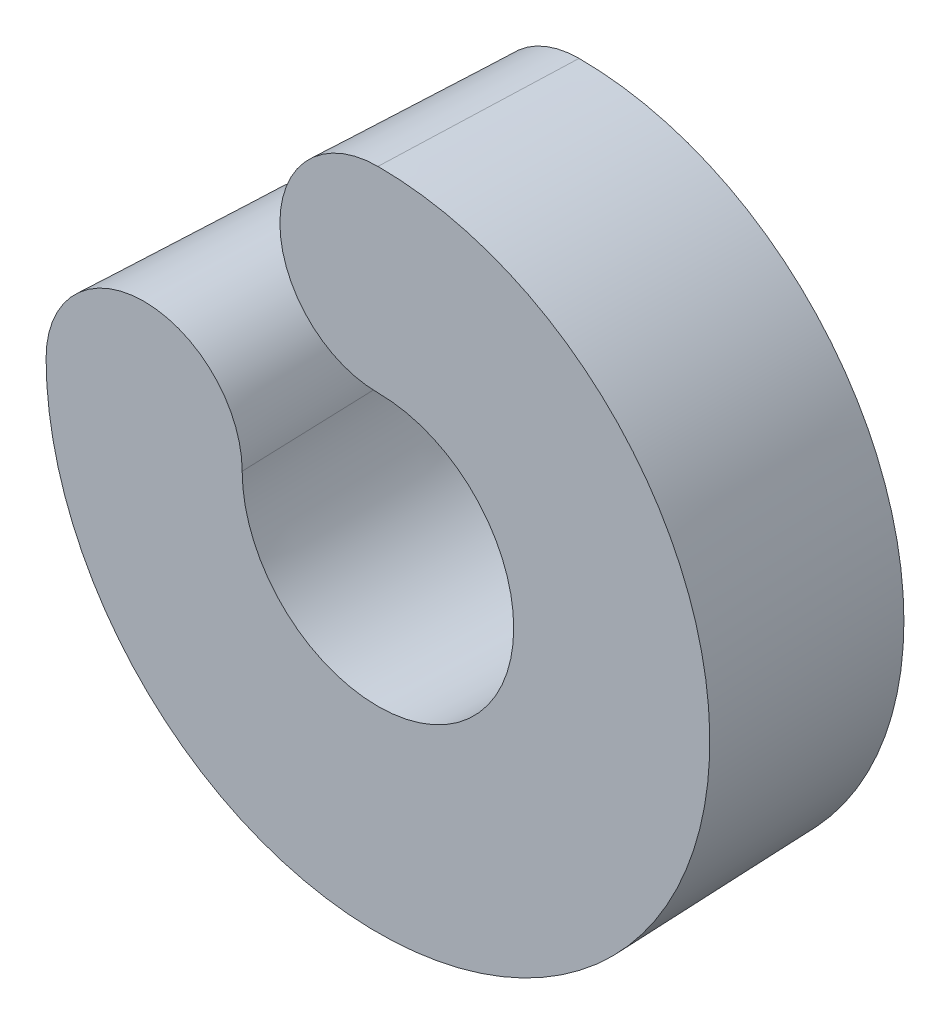
ISO-10303-21;
HEADER;
FILE_DESCRIPTION(('STEP AP214'),'2;1');
FILE_NAME('part.step','',(''),(''),'','','');
FILE_SCHEMA(('AUTOMOTIVE_DESIGN { 1 0 10303 214 1 1 1 1 }'));
ENDSEC;
DATA;
#1=APPLICATION_CONTEXT('core data for automotive mechanical design processes');
#2=APPLICATION_PROTOCOL_DEFINITION('international standard','automotive_design',2000,#1);
#3=PRODUCT_CONTEXT('',#1,'mechanical');
#4=PRODUCT('Part','Part','',(#3));
#5=PRODUCT_RELATED_PRODUCT_CATEGORY('part','',(#4));
#6=PRODUCT_DEFINITION_FORMATION('','',#4);
#7=PRODUCT_DEFINITION_CONTEXT('part definition',#1,'design');
#8=PRODUCT_DEFINITION('design','',#6,#7);
#9=PRODUCT_DEFINITION_SHAPE('','',#8);
#10=(LENGTH_UNIT() NAMED_UNIT(*) SI_UNIT(.MILLI.,.METRE.));
#11=(NAMED_UNIT(*) PLANE_ANGLE_UNIT() SI_UNIT($,.RADIAN.));
#12=(NAMED_UNIT(*) SI_UNIT($,.STERADIAN.) SOLID_ANGLE_UNIT());
#13=UNCERTAINTY_MEASURE_WITH_UNIT(LENGTH_MEASURE(1.E-05),#10,'distance_accuracy_value','');
#14=(GEOMETRIC_REPRESENTATION_CONTEXT(3) GLOBAL_UNCERTAINTY_ASSIGNED_CONTEXT((#13)) GLOBAL_UNIT_ASSIGNED_CONTEXT((#10,
#11,#12)) REPRESENTATION_CONTEXT('',''));
#15=CARTESIAN_POINT('',(0.,0.,0.));
#16=DIRECTION('',(0.,0.,1.));
#17=DIRECTION('',(1.,0.,0.));
#18=AXIS2_PLACEMENT_3D('',#15,#16,#17);
#19=CARTESIAN_POINT('',(0.,0.,2.));
#20=DIRECTION('',(0.,0.,-1.));
#21=DIRECTION('',(1.,0.,0.));
#22=AXIS2_PLACEMENT_3D('',#19,#20,#21);
#23=CONICAL_SURFACE('',#22,1.35,0.0349065850398867);
#24=CARTESIAN_POINT('',(0.,0.,0.));
#25=DIRECTION('',(0.,0.,1.));
#26=DIRECTION('',(1.,0.,0.));
#27=AXIS2_PLACEMENT_3D('',#24,#25,#26);
#28=CIRCLE('',#27,1.4198415389835);
#29=CARTESIAN_POINT('',(0.,1.4198415389835,0.));
#30=VERTEX_POINT('',#29);
#31=CARTESIAN_POINT('',(-1.4198415389835,0.,0.));
#32=VERTEX_POINT('',#31);
#33=EDGE_CURVE('E80',#30,#32,#28,.F.);
#34=ORIENTED_EDGE('',*,*,#33,.T.);
#35=DIRECTION('',(0.0348994967025011,0.,0.999390827019096));
#36=VECTOR('',#35,1.);
#37=CARTESIAN_POINT('',(-1.35,0.,2.));
#38=LINE('',#37,#36);
#39=CARTESIAN_POINT('',(-1.35,0.,2.));
#40=VERTEX_POINT('',#39);
#41=EDGE_CURVE('E11',#40,#32,#38,.F.);
#42=ORIENTED_EDGE('',*,*,#41,.F.);
#43=CARTESIAN_POINT('',(0.,0.,2.));
#44=DIRECTION('',(0.,0.,-1.));
#45=DIRECTION('',(1.,0.,0.));
#46=AXIS2_PLACEMENT_3D('',#43,#44,#45);
#47=CIRCLE('',#46,1.35);
#48=CARTESIAN_POINT('',(0.,1.35,2.));
#49=VERTEX_POINT('',#48);
#50=EDGE_CURVE('E81',#49,#40,#47,.T.);
#51=ORIENTED_EDGE('',*,*,#50,.F.);
#52=DIRECTION('',(0.,-0.034899496702501,0.999390827019096));
#53=VECTOR('',#52,1.);
#54=CARTESIAN_POINT('',(0.,1.35,2.));
#55=LINE('',#54,#53);
#56=EDGE_CURVE('E28',#49,#30,#55,.F.);
#57=ORIENTED_EDGE('',*,*,#56,.T.);
#58=EDGE_LOOP('',(#34,#42,#51,#57));
#59=FACE_BOUND('',#58,.T.);
#60=ADVANCED_FACE('F24',(#59),#23,.F.);
#61=CARTESIAN_POINT('',(-2.325,0.,2.));
#62=DIRECTION('',(0.,0.,1.));
#63=DIRECTION('',(1.,0.,0.));
#64=AXIS2_PLACEMENT_3D('',#61,#62,#63);
#65=CONICAL_SURFACE('',#64,0.975,0.0349065850398867);
#66=CARTESIAN_POINT('',(-2.325,0.,0.));
#67=DIRECTION('',(0.,0.,1.));
#68=DIRECTION('',(1.,0.,0.));
#69=AXIS2_PLACEMENT_3D('',#66,#67,#68);
#70=CIRCLE('',#69,0.905158461016504);
#71=CARTESIAN_POINT('',(-3.2301584610165,0.,0.));
#72=VERTEX_POINT('',#71);
#73=EDGE_CURVE('E74',#32,#72,#70,.T.);
#74=ORIENTED_EDGE('',*,*,#73,.T.);
#75=DIRECTION('',(-0.0348994967025011,0.,0.999390827019096));
#76=VECTOR('',#75,1.);
#77=CARTESIAN_POINT('',(-3.3,0.,2.));
#78=LINE('',#77,#76);
#79=CARTESIAN_POINT('',(-3.3,0.,2.));
#80=VERTEX_POINT('',#79);
#81=EDGE_CURVE('E34',#80,#72,#78,.F.);
#82=ORIENTED_EDGE('',*,*,#81,.F.);
#83=CARTESIAN_POINT('',(-2.325,0.,2.));
#84=DIRECTION('',(0.,0.,1.));
#85=DIRECTION('',(1.,0.,0.));
#86=AXIS2_PLACEMENT_3D('',#83,#84,#85);
#87=CIRCLE('',#86,0.975);
#88=EDGE_CURVE('E83',#40,#80,#87,.T.);
#89=ORIENTED_EDGE('',*,*,#88,.F.);
#90=ORIENTED_EDGE('',*,*,#41,.T.);
#91=EDGE_LOOP('',(#74,#82,#89,#90));
#92=FACE_BOUND('',#91,.T.);
#93=ADVANCED_FACE('F97',(#92),#65,.T.);
#94=CARTESIAN_POINT('',(0.,0.,2.));
#95=DIRECTION('',(0.,0.,1.));
#96=DIRECTION('',(1.,0.,0.));
#97=AXIS2_PLACEMENT_3D('',#94,#95,#96);
#98=CONICAL_SURFACE('',#97,3.3,0.0349065850398867);
#99=CARTESIAN_POINT('',(0.,0.,0.));
#100=DIRECTION('',(0.,0.,1.));
#101=DIRECTION('',(1.,0.,0.));
#102=AXIS2_PLACEMENT_3D('',#99,#100,#101);
#103=CIRCLE('',#102,3.2301584610165);
#104=CARTESIAN_POINT('',(0.,3.23015846101651,0.));
#105=VERTEX_POINT('',#104);
#106=EDGE_CURVE('E68',#72,#105,#103,.T.);
#107=ORIENTED_EDGE('',*,*,#106,.T.);
#108=DIRECTION('',(0.,0.034899496702501,0.999390827019096));
#109=VECTOR('',#108,1.);
#110=CARTESIAN_POINT('',(0.,3.3,2.));
#111=LINE('',#110,#109);
#112=CARTESIAN_POINT('',(0.,3.3,2.));
#113=VERTEX_POINT('',#112);
#114=EDGE_CURVE('E71',#113,#105,#111,.F.);
#115=ORIENTED_EDGE('',*,*,#114,.F.);
#116=CARTESIAN_POINT('',(0.,0.,2.));
#117=DIRECTION('',(0.,0.,1.));
#118=DIRECTION('',(1.,0.,0.));
#119=AXIS2_PLACEMENT_3D('',#116,#117,#118);
#120=CIRCLE('',#119,3.3);
#121=EDGE_CURVE('E90',#80,#113,#120,.T.);
#122=ORIENTED_EDGE('',*,*,#121,.F.);
#123=ORIENTED_EDGE('',*,*,#81,.T.);
#124=EDGE_LOOP('',(#107,#115,#122,#123));
#125=FACE_BOUND('',#124,.T.);
#126=ADVANCED_FACE('F69',(#125),#98,.T.);
#127=CARTESIAN_POINT('',(0.,2.325,2.));
#128=DIRECTION('',(0.,0.,1.));
#129=DIRECTION('',(1.,0.,0.));
#130=AXIS2_PLACEMENT_3D('',#127,#128,#129);
#131=CONICAL_SURFACE('',#130,0.975,0.0349065850398867);
#132=CARTESIAN_POINT('',(0.,2.325,0.));
#133=DIRECTION('',(0.,0.,1.));
#134=DIRECTION('',(1.,0.,0.));
#135=AXIS2_PLACEMENT_3D('',#132,#133,#134);
#136=CIRCLE('',#135,0.905158461016504);
#137=EDGE_CURVE('E59',#105,#30,#136,.T.);
#138=ORIENTED_EDGE('',*,*,#137,.T.);
#139=ORIENTED_EDGE('',*,*,#56,.F.);
#140=CARTESIAN_POINT('',(0.,2.325,2.));
#141=DIRECTION('',(0.,0.,1.));
#142=DIRECTION('',(1.,0.,0.));
#143=AXIS2_PLACEMENT_3D('',#140,#141,#142);
#144=CIRCLE('',#143,0.975);
#145=EDGE_CURVE('E42',#113,#49,#144,.T.);
#146=ORIENTED_EDGE('',*,*,#145,.F.);
#147=ORIENTED_EDGE('',*,*,#114,.T.);
#148=EDGE_LOOP('',(#138,#139,#146,#147));
#149=FACE_BOUND('',#148,.T.);
#150=ADVANCED_FACE('F26',(#149),#131,.T.);
#151=CARTESIAN_POINT('',(0.,1.1625,2.));
#152=DIRECTION('',(0.,0.,1.));
#153=DIRECTION('',(1.,0.,0.));
#154=AXIS2_PLACEMENT_3D('',#151,#152,#153);
#155=PLANE('',#154);
#156=ORIENTED_EDGE('',*,*,#50,.T.);
#157=ORIENTED_EDGE('',*,*,#88,.T.);
#158=ORIENTED_EDGE('',*,*,#121,.T.);
#159=ORIENTED_EDGE('',*,*,#145,.T.);
#160=EDGE_LOOP('',(#156,#157,#158,#159));
#161=FACE_BOUND('',#160,.T.);
#162=ADVANCED_FACE('F93',(#161),#155,.T.);
#163=CARTESIAN_POINT('',(0.,1.1625,0.));
#164=DIRECTION('',(0.,0.,1.));
#165=DIRECTION('',(1.,0.,0.));
#166=AXIS2_PLACEMENT_3D('',#163,#164,#165);
#167=PLANE('',#166);
#168=ORIENTED_EDGE('',*,*,#33,.F.);
#169=ORIENTED_EDGE('',*,*,#137,.F.);
#170=ORIENTED_EDGE('',*,*,#106,.F.);
#171=ORIENTED_EDGE('',*,*,#73,.F.);
#172=EDGE_LOOP('',(#168,#169,#170,#171));
#173=FACE_BOUND('',#172,.T.);
#174=ADVANCED_FACE('F78',(#173),#167,.F.);
#175=CLOSED_SHELL('',(#60,#93,#126,#150,#162,#174));
#176=MANIFOLD_SOLID_BREP('B2',#175);
#177=ADVANCED_BREP_SHAPE_REPRESENTATION('',(#18,#176),#14);
#178=SHAPE_DEFINITION_REPRESENTATION(#9,#177);
ENDSEC;
END-ISO-10303-21;
